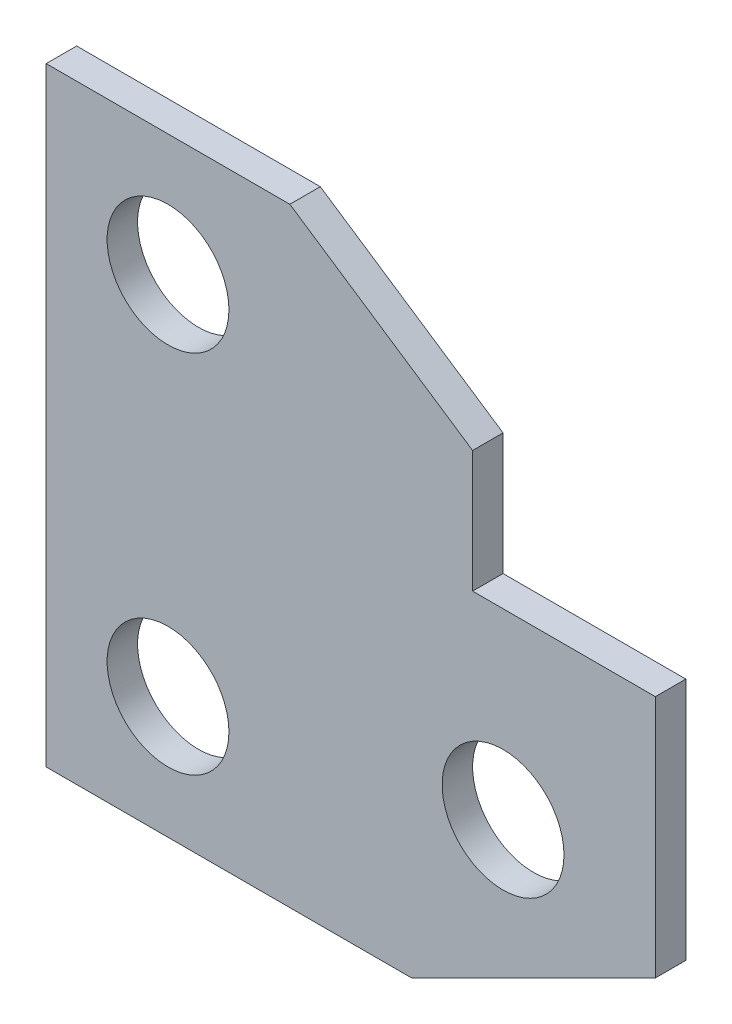
ISO-10303-21;
HEADER;
FILE_DESCRIPTION(('STEP AP214'),'2;1');
FILE_NAME('part.step','',(''),(''),'','','');
FILE_SCHEMA(('AUTOMOTIVE_DESIGN { 1 0 10303 214 1 1 1 1 }'));
ENDSEC;
DATA;
#1=APPLICATION_CONTEXT('core data for automotive mechanical design processes');
#2=APPLICATION_PROTOCOL_DEFINITION('international standard','automotive_design',2000,#1);
#3=PRODUCT_CONTEXT('',#1,'mechanical');
#4=PRODUCT('Part','Part','',(#3));
#5=PRODUCT_RELATED_PRODUCT_CATEGORY('part','',(#4));
#6=PRODUCT_DEFINITION_FORMATION('','',#4);
#7=PRODUCT_DEFINITION_CONTEXT('part definition',#1,'design');
#8=PRODUCT_DEFINITION('design','',#6,#7);
#9=PRODUCT_DEFINITION_SHAPE('','',#8);
#10=(LENGTH_UNIT() NAMED_UNIT(*) SI_UNIT(.MILLI.,.METRE.));
#11=(NAMED_UNIT(*) PLANE_ANGLE_UNIT() SI_UNIT($,.RADIAN.));
#12=(NAMED_UNIT(*) SI_UNIT($,.STERADIAN.) SOLID_ANGLE_UNIT());
#13=UNCERTAINTY_MEASURE_WITH_UNIT(LENGTH_MEASURE(1.E-05),#10,'distance_accuracy_value','');
#14=(GEOMETRIC_REPRESENTATION_CONTEXT(3) GLOBAL_UNCERTAINTY_ASSIGNED_CONTEXT((#13)) GLOBAL_UNIT_ASSIGNED_CONTEXT((#10,
#11,#12)) REPRESENTATION_CONTEXT('',''));
#15=CARTESIAN_POINT('',(0.,0.,0.));
#16=DIRECTION('',(0.,0.,1.));
#17=DIRECTION('',(1.,0.,0.));
#18=AXIS2_PLACEMENT_3D('',#15,#16,#17);
#19=CARTESIAN_POINT('',(0.,0.,5.));
#20=DIRECTION('',(0.,0.,1.));
#21=DIRECTION('',(1.,0.,0.));
#22=AXIS2_PLACEMENT_3D('',#19,#20,#21);
#23=PLANE('',#22);
#24=CARTESIAN_POINT('',(-53.2941176470589,13.764705882353,5.));
#25=DIRECTION('',(0.,0.,1.));
#26=DIRECTION('',(1.,0.,0.));
#27=AXIS2_PLACEMENT_3D('',#24,#25,#26);
#28=CIRCLE('',#27,10.);
#29=CARTESIAN_POINT('',(-43.2941176470589,13.764705882353,5.));
#30=VERTEX_POINT('',#29);
#31=EDGE_CURVE('E213',#30,#30,#28,.T.);
#32=ORIENTED_EDGE('',*,*,#31,.F.);
#33=EDGE_LOOP('',(#32));
#34=FACE_BOUND('',#33,.T.);
#35=DIRECTION('',(1.,0.,0.));
#36=VECTOR('',#35,1.);
#37=CARTESIAN_POINT('',(-73.2941176470589,-6.23529411764703,5.));
#38=LINE('',#37,#36);
#39=CARTESIAN_POINT('',(-73.2941176470589,-6.23529411764703,5.));
#40=VERTEX_POINT('',#39);
#41=CARTESIAN_POINT('',(-13.2941176470589,-6.23529411764703,5.));
#42=VERTEX_POINT('',#41);
#43=EDGE_CURVE('E164',#40,#42,#38,.T.);
#44=ORIENTED_EDGE('',*,*,#43,.T.);
#45=DIRECTION('',(0.894427190999916,0.447213595499958,0.));
#46=VECTOR('',#45,1.);
#47=CARTESIAN_POINT('',(-13.2941176470589,-6.23529411764703,5.));
#48=LINE('',#47,#46);
#49=CARTESIAN_POINT('',(26.7058823529411,13.764705882353,5.));
#50=VERTEX_POINT('',#49);
#51=EDGE_CURVE('E100',#42,#50,#48,.T.);
#52=ORIENTED_EDGE('',*,*,#51,.T.);
#53=DIRECTION('',(0.,1.,0.));
#54=VECTOR('',#53,1.);
#55=CARTESIAN_POINT('',(26.7058823529411,13.764705882353,5.));
#56=LINE('',#55,#54);
#57=CARTESIAN_POINT('',(26.7058823529411,53.764705882353,5.));
#58=VERTEX_POINT('',#57);
#59=EDGE_CURVE('E185',#50,#58,#56,.T.);
#60=ORIENTED_EDGE('',*,*,#59,.T.);
#61=DIRECTION('',(-1.,0.,0.));
#62=VECTOR('',#61,1.);
#63=CARTESIAN_POINT('',(26.7058823529411,53.764705882353,5.));
#64=LINE('',#63,#62);
#65=CARTESIAN_POINT('',(-3.29411764705887,53.764705882353,5.));
#66=VERTEX_POINT('',#65);
#67=EDGE_CURVE('E199',#58,#66,#64,.T.);
#68=ORIENTED_EDGE('',*,*,#67,.T.);
#69=DIRECTION('',(0.,1.,0.));
#70=VECTOR('',#69,1.);
#71=CARTESIAN_POINT('',(-3.29411764705888,73.764705882353,5.));
#72=LINE('',#71,#70);
#73=CARTESIAN_POINT('',(-3.29411764705888,73.764705882353,5.));
#74=VERTEX_POINT('',#73);
#75=EDGE_CURVE('E119',#66,#74,#72,.T.);
#76=ORIENTED_EDGE('',*,*,#75,.T.);
#77=DIRECTION('',(-0.832050294337844,0.554700196225229,0.));
#78=VECTOR('',#77,1.);
#79=CARTESIAN_POINT('',(-3.29411764705888,73.764705882353,5.));
#80=LINE('',#79,#78);
#81=CARTESIAN_POINT('',(-33.2941176470589,93.764705882353,5.));
#82=VERTEX_POINT('',#81);
#83=EDGE_CURVE('E113',#74,#82,#80,.T.);
#84=ORIENTED_EDGE('',*,*,#83,.T.);
#85=DIRECTION('',(-1.,0.,0.));
#86=VECTOR('',#85,1.);
#87=CARTESIAN_POINT('',(-33.2941176470589,93.764705882353,5.));
#88=LINE('',#87,#86);
#89=CARTESIAN_POINT('',(-73.2941176470589,93.764705882353,5.));
#90=VERTEX_POINT('',#89);
#91=EDGE_CURVE('E117',#82,#90,#88,.T.);
#92=ORIENTED_EDGE('',*,*,#91,.T.);
#93=DIRECTION('',(0.,-1.,0.));
#94=VECTOR('',#93,1.);
#95=CARTESIAN_POINT('',(-73.2941176470589,93.764705882353,5.));
#96=LINE('',#95,#94);
#97=EDGE_CURVE('E57',#90,#40,#96,.T.);
#98=ORIENTED_EDGE('',*,*,#97,.T.);
#99=EDGE_LOOP('',(#44,#52,#60,#68,#76,#84,#92,#98));
#100=FACE_BOUND('',#99,.T.);
#101=CARTESIAN_POINT('',(-53.2941176470589,73.764705882353,5.));
#102=DIRECTION('',(0.,0.,1.));
#103=DIRECTION('',(1.,0.,0.));
#104=AXIS2_PLACEMENT_3D('',#101,#102,#103);
#105=CIRCLE('',#104,10.);
#106=CARTESIAN_POINT('',(-43.2941176470589,73.764705882353,5.));
#107=VERTEX_POINT('',#106);
#108=EDGE_CURVE('E146',#107,#107,#105,.T.);
#109=ORIENTED_EDGE('',*,*,#108,.F.);
#110=EDGE_LOOP('',(#109));
#111=FACE_BOUND('',#110,.T.);
#112=CARTESIAN_POINT('',(1.70588235294112,23.764705882353,5.));
#113=DIRECTION('',(0.,0.,1.));
#114=DIRECTION('',(1.,0.,0.));
#115=AXIS2_PLACEMENT_3D('',#112,#113,#114);
#116=CIRCLE('',#115,9.99999999999999);
#117=CARTESIAN_POINT('',(11.7058823529411,23.764705882353,5.));
#118=VERTEX_POINT('',#117);
#119=EDGE_CURVE('E221',#118,#118,#116,.T.);
#120=ORIENTED_EDGE('',*,*,#119,.F.);
#121=EDGE_LOOP('',(#120));
#122=FACE_BOUND('',#121,.T.);
#123=ADVANCED_FACE('F39',(#34,#100,#111,#122),#23,.T.);
#124=CARTESIAN_POINT('',(0.,0.,0.));
#125=DIRECTION('',(0.,0.,1.));
#126=DIRECTION('',(1.,0.,0.));
#127=AXIS2_PLACEMENT_3D('',#124,#125,#126);
#128=PLANE('',#127);
#129=DIRECTION('',(1.,0.,0.));
#130=VECTOR('',#129,1.);
#131=CARTESIAN_POINT('',(-73.2941176470589,-6.23529411764703,0.));
#132=LINE('',#131,#130);
#133=CARTESIAN_POINT('',(-73.2941176470589,-6.23529411764703,0.));
#134=VERTEX_POINT('',#133);
#135=CARTESIAN_POINT('',(-13.2941176470589,-6.23529411764703,0.));
#136=VERTEX_POINT('',#135);
#137=EDGE_CURVE('E141',#134,#136,#132,.T.);
#138=ORIENTED_EDGE('',*,*,#137,.F.);
#139=DIRECTION('',(0.,-1.,0.));
#140=VECTOR('',#139,1.);
#141=CARTESIAN_POINT('',(-73.2941176470589,93.764705882353,0.));
#142=LINE('',#141,#140);
#143=CARTESIAN_POINT('',(-73.2941176470589,93.764705882353,0.));
#144=VERTEX_POINT('',#143);
#145=EDGE_CURVE('E92',#144,#134,#142,.T.);
#146=ORIENTED_EDGE('',*,*,#145,.F.);
#147=DIRECTION('',(-1.,0.,0.));
#148=VECTOR('',#147,1.);
#149=CARTESIAN_POINT('',(-33.2941176470589,93.764705882353,0.));
#150=LINE('',#149,#148);
#151=CARTESIAN_POINT('',(-33.2941176470589,93.764705882353,0.));
#152=VERTEX_POINT('',#151);
#153=EDGE_CURVE('E86',#152,#144,#150,.T.);
#154=ORIENTED_EDGE('',*,*,#153,.F.);
#155=DIRECTION('',(-0.832050294337844,0.554700196225229,0.));
#156=VECTOR('',#155,1.);
#157=CARTESIAN_POINT('',(-3.29411764705888,73.764705882353,0.));
#158=LINE('',#157,#156);
#159=CARTESIAN_POINT('',(-3.29411764705888,73.764705882353,0.));
#160=VERTEX_POINT('',#159);
#161=EDGE_CURVE('E128',#160,#152,#158,.T.);
#162=ORIENTED_EDGE('',*,*,#161,.F.);
#163=DIRECTION('',(0.,1.,0.));
#164=VECTOR('',#163,1.);
#165=CARTESIAN_POINT('',(-3.29411764705888,73.764705882353,0.));
#166=LINE('',#165,#164);
#167=CARTESIAN_POINT('',(-3.29411764705887,53.764705882353,0.));
#168=VERTEX_POINT('',#167);
#169=EDGE_CURVE('E155',#168,#160,#166,.T.);
#170=ORIENTED_EDGE('',*,*,#169,.F.);
#171=DIRECTION('',(-1.,0.,0.));
#172=VECTOR('',#171,1.);
#173=CARTESIAN_POINT('',(26.7058823529411,53.764705882353,0.));
#174=LINE('',#173,#172);
#175=CARTESIAN_POINT('',(26.7058823529411,53.764705882353,0.));
#176=VERTEX_POINT('',#175);
#177=EDGE_CURVE('E152',#176,#168,#174,.T.);
#178=ORIENTED_EDGE('',*,*,#177,.F.);
#179=DIRECTION('',(0.,1.,0.));
#180=VECTOR('',#179,1.);
#181=CARTESIAN_POINT('',(26.7058823529411,13.764705882353,0.));
#182=LINE('',#181,#180);
#183=CARTESIAN_POINT('',(26.7058823529411,13.764705882353,0.));
#184=VERTEX_POINT('',#183);
#185=EDGE_CURVE('E149',#184,#176,#182,.T.);
#186=ORIENTED_EDGE('',*,*,#185,.F.);
#187=DIRECTION('',(0.894427190999916,0.447213595499958,0.));
#188=VECTOR('',#187,1.);
#189=CARTESIAN_POINT('',(-13.2941176470589,-6.23529411764703,0.));
#190=LINE('',#189,#188);
#191=EDGE_CURVE('E145',#136,#184,#190,.T.);
#192=ORIENTED_EDGE('',*,*,#191,.F.);
#193=EDGE_LOOP('',(#138,#146,#154,#162,#170,#178,#186,#192));
#194=FACE_BOUND('',#193,.T.);
#195=CARTESIAN_POINT('',(-53.2941176470589,73.764705882353,0.));
#196=DIRECTION('',(0.,0.,1.));
#197=DIRECTION('',(1.,0.,0.));
#198=AXIS2_PLACEMENT_3D('',#195,#196,#197);
#199=CIRCLE('',#198,10.);
#200=CARTESIAN_POINT('',(-43.2941176470589,73.764705882353,0.));
#201=VERTEX_POINT('',#200);
#202=EDGE_CURVE('E209',#201,#201,#199,.T.);
#203=ORIENTED_EDGE('',*,*,#202,.T.);
#204=EDGE_LOOP('',(#203));
#205=FACE_BOUND('',#204,.T.);
#206=CARTESIAN_POINT('',(-53.2941176470589,13.764705882353,0.));
#207=DIRECTION('',(0.,0.,1.));
#208=DIRECTION('',(1.,0.,0.));
#209=AXIS2_PLACEMENT_3D('',#206,#207,#208);
#210=CIRCLE('',#209,10.);
#211=CARTESIAN_POINT('',(-43.2941176470589,13.764705882353,0.));
#212=VERTEX_POINT('',#211);
#213=EDGE_CURVE('E217',#212,#212,#210,.T.);
#214=ORIENTED_EDGE('',*,*,#213,.T.);
#215=EDGE_LOOP('',(#214));
#216=FACE_BOUND('',#215,.T.);
#217=CARTESIAN_POINT('',(1.70588235294112,23.764705882353,0.));
#218=DIRECTION('',(0.,0.,1.));
#219=DIRECTION('',(1.,0.,0.));
#220=AXIS2_PLACEMENT_3D('',#217,#218,#219);
#221=CIRCLE('',#220,9.99999999999999);
#222=CARTESIAN_POINT('',(11.7058823529411,23.764705882353,0.));
#223=VERTEX_POINT('',#222);
#224=EDGE_CURVE('E225',#223,#223,#221,.T.);
#225=ORIENTED_EDGE('',*,*,#224,.T.);
#226=EDGE_LOOP('',(#225));
#227=FACE_BOUND('',#226,.T.);
#228=ADVANCED_FACE('F189',(#194,#205,#216,#227),#128,.F.);
#229=CARTESIAN_POINT('',(-73.2941176470589,-6.23529411764703,5.));
#230=DIRECTION('',(0.,1.,0.));
#231=DIRECTION('',(-1.,0.,0.));
#232=AXIS2_PLACEMENT_3D('',#229,#230,#231);
#233=PLANE('',#232);
#234=ORIENTED_EDGE('',*,*,#137,.T.);
#235=DIRECTION('',(0.,0.,-1.));
#236=VECTOR('',#235,1.);
#237=CARTESIAN_POINT('',(-13.2941176470589,-6.23529411764703,5.));
#238=LINE('',#237,#236);
#239=EDGE_CURVE('E11',#42,#136,#238,.T.);
#240=ORIENTED_EDGE('',*,*,#239,.F.);
#241=ORIENTED_EDGE('',*,*,#43,.F.);
#242=DIRECTION('',(0.,0.,-1.));
#243=VECTOR('',#242,1.);
#244=CARTESIAN_POINT('',(-73.2941176470589,-6.23529411764703,5.));
#245=LINE('',#244,#243);
#246=EDGE_CURVE('E137',#40,#134,#245,.T.);
#247=ORIENTED_EDGE('',*,*,#246,.T.);
#248=EDGE_LOOP('',(#234,#240,#241,#247));
#249=FACE_BOUND('',#248,.T.);
#250=ADVANCED_FACE('F41',(#249),#233,.F.);
#251=CARTESIAN_POINT('',(-13.2941176470589,-6.23529411764703,5.));
#252=DIRECTION('',(-0.447213595499958,0.894427190999916,0.));
#253=DIRECTION('',(-0.894427190999916,-0.447213595499958,0.));
#254=AXIS2_PLACEMENT_3D('',#251,#252,#253);
#255=PLANE('',#254);
#256=ORIENTED_EDGE('',*,*,#191,.T.);
#257=DIRECTION('',(0.,0.,-1.));
#258=VECTOR('',#257,1.);
#259=CARTESIAN_POINT('',(26.7058823529411,13.764705882353,5.));
#260=LINE('',#259,#258);
#261=EDGE_CURVE('E49',#50,#184,#260,.T.);
#262=ORIENTED_EDGE('',*,*,#261,.F.);
#263=ORIENTED_EDGE('',*,*,#51,.F.);
#264=ORIENTED_EDGE('',*,*,#239,.T.);
#265=EDGE_LOOP('',(#256,#262,#263,#264));
#266=FACE_BOUND('',#265,.T.);
#267=ADVANCED_FACE('F260',(#266),#255,.F.);
#268=CARTESIAN_POINT('',(26.7058823529411,13.764705882353,5.));
#269=DIRECTION('',(-1.,0.,0.));
#270=DIRECTION('',(0.,-1.,0.));
#271=AXIS2_PLACEMENT_3D('',#268,#269,#270);
#272=PLANE('',#271);
#273=ORIENTED_EDGE('',*,*,#185,.T.);
#274=DIRECTION('',(0.,0.,-1.));
#275=VECTOR('',#274,1.);
#276=CARTESIAN_POINT('',(26.7058823529411,53.764705882353,5.));
#277=LINE('',#276,#275);
#278=EDGE_CURVE('E175',#58,#176,#277,.T.);
#279=ORIENTED_EDGE('',*,*,#278,.F.);
#280=ORIENTED_EDGE('',*,*,#59,.F.);
#281=ORIENTED_EDGE('',*,*,#261,.T.);
#282=EDGE_LOOP('',(#273,#279,#280,#281));
#283=FACE_BOUND('',#282,.T.);
#284=ADVANCED_FACE('F183',(#283),#272,.F.);
#285=CARTESIAN_POINT('',(26.7058823529411,53.764705882353,5.));
#286=DIRECTION('',(0.,-1.,0.));
#287=DIRECTION('',(1.,0.,0.));
#288=AXIS2_PLACEMENT_3D('',#285,#286,#287);
#289=PLANE('',#288);
#290=ORIENTED_EDGE('',*,*,#177,.T.);
#291=DIRECTION('',(0.,0.,-1.));
#292=VECTOR('',#291,1.);
#293=CARTESIAN_POINT('',(-3.29411764705887,53.764705882353,5.));
#294=LINE('',#293,#292);
#295=EDGE_CURVE('E171',#66,#168,#294,.T.);
#296=ORIENTED_EDGE('',*,*,#295,.F.);
#297=ORIENTED_EDGE('',*,*,#67,.F.);
#298=ORIENTED_EDGE('',*,*,#278,.T.);
#299=EDGE_LOOP('',(#290,#296,#297,#298));
#300=FACE_BOUND('',#299,.T.);
#301=ADVANCED_FACE('F194',(#300),#289,.F.);
#302=CARTESIAN_POINT('',(-3.29411764705888,73.764705882353,5.));
#303=DIRECTION('',(-1.,0.,0.));
#304=DIRECTION('',(0.,-1.,0.));
#305=AXIS2_PLACEMENT_3D('',#302,#303,#304);
#306=PLANE('',#305);
#307=ORIENTED_EDGE('',*,*,#169,.T.);
#308=DIRECTION('',(0.,0.,-1.));
#309=VECTOR('',#308,1.);
#310=CARTESIAN_POINT('',(-3.29411764705888,73.764705882353,5.));
#311=LINE('',#310,#309);
#312=EDGE_CURVE('E130',#74,#160,#311,.T.);
#313=ORIENTED_EDGE('',*,*,#312,.F.);
#314=ORIENTED_EDGE('',*,*,#75,.F.);
#315=ORIENTED_EDGE('',*,*,#295,.T.);
#316=EDGE_LOOP('',(#307,#313,#314,#315));
#317=FACE_BOUND('',#316,.T.);
#318=ADVANCED_FACE('F197',(#317),#306,.F.);
#319=CARTESIAN_POINT('',(-3.29411764705888,73.764705882353,5.));
#320=DIRECTION('',(-0.554700196225229,-0.832050294337844,0.));
#321=DIRECTION('',(0.832050294337844,-0.554700196225229,0.));
#322=AXIS2_PLACEMENT_3D('',#319,#320,#321);
#323=PLANE('',#322);
#324=ORIENTED_EDGE('',*,*,#161,.T.);
#325=DIRECTION('',(0.,0.,-1.));
#326=VECTOR('',#325,1.);
#327=CARTESIAN_POINT('',(-33.2941176470589,93.764705882353,5.));
#328=LINE('',#327,#326);
#329=EDGE_CURVE('E125',#82,#152,#328,.T.);
#330=ORIENTED_EDGE('',*,*,#329,.F.);
#331=ORIENTED_EDGE('',*,*,#83,.F.);
#332=ORIENTED_EDGE('',*,*,#312,.T.);
#333=EDGE_LOOP('',(#324,#330,#331,#332));
#334=FACE_BOUND('',#333,.T.);
#335=ADVANCED_FACE('F126',(#334),#323,.F.);
#336=CARTESIAN_POINT('',(-33.2941176470589,93.764705882353,5.));
#337=DIRECTION('',(0.,-1.,0.));
#338=DIRECTION('',(0.,0.,-1.));
#339=AXIS2_PLACEMENT_3D('',#336,#337,#338);
#340=PLANE('',#339);
#341=ORIENTED_EDGE('',*,*,#153,.T.);
#342=DIRECTION('',(0.,0.,-1.));
#343=VECTOR('',#342,1.);
#344=CARTESIAN_POINT('',(-73.2941176470589,93.764705882353,5.));
#345=LINE('',#344,#343);
#346=EDGE_CURVE('E131',#90,#144,#345,.T.);
#347=ORIENTED_EDGE('',*,*,#346,.F.);
#348=ORIENTED_EDGE('',*,*,#91,.F.);
#349=ORIENTED_EDGE('',*,*,#329,.T.);
#350=EDGE_LOOP('',(#341,#347,#348,#349));
#351=FACE_BOUND('',#350,.T.);
#352=ADVANCED_FACE('F133',(#351),#340,.F.);
#353=CARTESIAN_POINT('',(-73.2941176470589,93.764705882353,5.));
#354=DIRECTION('',(1.,0.,0.));
#355=DIRECTION('',(0.,1.,0.));
#356=AXIS2_PLACEMENT_3D('',#353,#354,#355);
#357=PLANE('',#356);
#358=ORIENTED_EDGE('',*,*,#145,.T.);
#359=ORIENTED_EDGE('',*,*,#246,.F.);
#360=ORIENTED_EDGE('',*,*,#97,.F.);
#361=ORIENTED_EDGE('',*,*,#346,.T.);
#362=EDGE_LOOP('',(#358,#359,#360,#361));
#363=FACE_BOUND('',#362,.T.);
#364=ADVANCED_FACE('F248',(#363),#357,.F.);
#365=CARTESIAN_POINT('',(-53.2941176470589,73.764705882353,5.));
#366=DIRECTION('',(0.,0.,-1.));
#367=DIRECTION('',(-1.,0.,0.));
#368=AXIS2_PLACEMENT_3D('',#365,#366,#367);
#369=CYLINDRICAL_SURFACE('',#368,10.);
#370=ORIENTED_EDGE('',*,*,#108,.T.);
#371=EDGE_LOOP('',(#370));
#372=FACE_BOUND('',#371,.T.);
#373=ORIENTED_EDGE('',*,*,#202,.F.);
#374=EDGE_LOOP('',(#373));
#375=FACE_BOUND('',#374,.T.);
#376=ADVANCED_FACE('F245',(#372,#375),#369,.F.);
#377=CARTESIAN_POINT('',(-53.2941176470589,13.764705882353,5.));
#378=DIRECTION('',(0.,0.,-1.));
#379=DIRECTION('',(-1.,0.,0.));
#380=AXIS2_PLACEMENT_3D('',#377,#378,#379);
#381=CYLINDRICAL_SURFACE('',#380,10.);
#382=ORIENTED_EDGE('',*,*,#31,.T.);
#383=EDGE_LOOP('',(#382));
#384=FACE_BOUND('',#383,.T.);
#385=ORIENTED_EDGE('',*,*,#213,.F.);
#386=EDGE_LOOP('',(#385));
#387=FACE_BOUND('',#386,.T.);
#388=ADVANCED_FACE('F324',(#384,#387),#381,.F.);
#389=CARTESIAN_POINT('',(1.70588235294112,23.764705882353,5.));
#390=DIRECTION('',(0.,0.,-1.));
#391=DIRECTION('',(-1.,0.,0.));
#392=AXIS2_PLACEMENT_3D('',#389,#390,#391);
#393=CYLINDRICAL_SURFACE('',#392,9.99999999999999);
#394=ORIENTED_EDGE('',*,*,#119,.T.);
#395=EDGE_LOOP('',(#394));
#396=FACE_BOUND('',#395,.T.);
#397=ORIENTED_EDGE('',*,*,#224,.F.);
#398=EDGE_LOOP('',(#397));
#399=FACE_BOUND('',#398,.T.);
#400=ADVANCED_FACE('F233',(#396,#399),#393,.F.);
#401=CLOSED_SHELL('',(#123,#228,#250,#267,#284,#301,#318,#335,#352,#364,#376,#388,#400));
#402=MANIFOLD_SOLID_BREP('B2',#401);
#403=ADVANCED_BREP_SHAPE_REPRESENTATION('',(#18,#402),#14);
#404=SHAPE_DEFINITION_REPRESENTATION(#9,#403);
ENDSEC;
END-ISO-10303-21;
